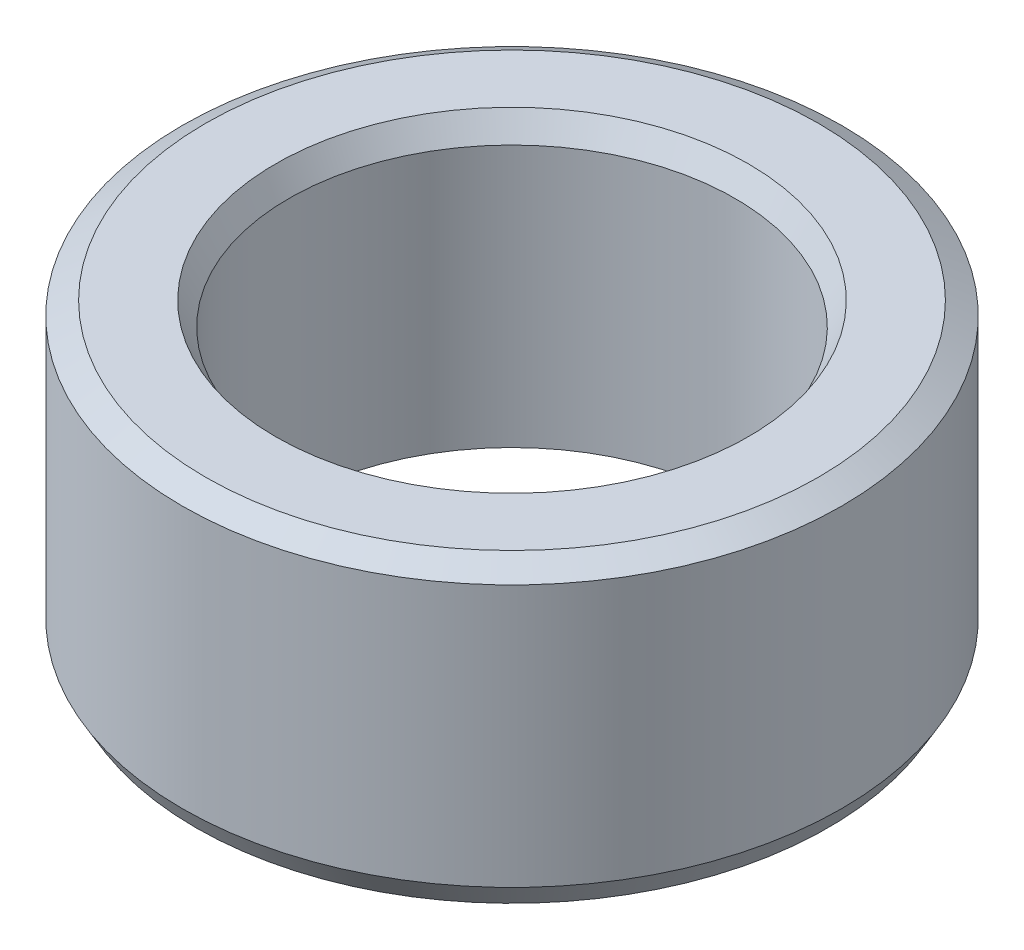
ISO-10303-21;
HEADER;
FILE_DESCRIPTION(('STEP AP214'),'2;1');
FILE_NAME('part.step','',(''),(''),'','','');
FILE_SCHEMA(('AUTOMOTIVE_DESIGN { 1 0 10303 214 1 1 1 1 }'));
ENDSEC;
DATA;
#1=APPLICATION_CONTEXT('core data for automotive mechanical design processes');
#2=APPLICATION_PROTOCOL_DEFINITION('international standard','automotive_design',2000,#1);
#3=PRODUCT_CONTEXT('',#1,'mechanical');
#4=PRODUCT('Part','Part','',(#3));
#5=PRODUCT_RELATED_PRODUCT_CATEGORY('part','',(#4));
#6=PRODUCT_DEFINITION_FORMATION('','',#4);
#7=PRODUCT_DEFINITION_CONTEXT('part definition',#1,'design');
#8=PRODUCT_DEFINITION('design','',#6,#7);
#9=PRODUCT_DEFINITION_SHAPE('','',#8);
#10=(LENGTH_UNIT() NAMED_UNIT(*) SI_UNIT(.MILLI.,.METRE.));
#11=(NAMED_UNIT(*) PLANE_ANGLE_UNIT() SI_UNIT($,.RADIAN.));
#12=(NAMED_UNIT(*) SI_UNIT($,.STERADIAN.) SOLID_ANGLE_UNIT());
#13=UNCERTAINTY_MEASURE_WITH_UNIT(LENGTH_MEASURE(1.E-05),#10,'distance_accuracy_value','');
#14=(GEOMETRIC_REPRESENTATION_CONTEXT(3) GLOBAL_UNCERTAINTY_ASSIGNED_CONTEXT((#13)) GLOBAL_UNIT_ASSIGNED_CONTEXT((#10,
#11,#12)) REPRESENTATION_CONTEXT('',''));
#15=CARTESIAN_POINT('',(0.,0.,0.));
#16=DIRECTION('',(0.,0.,1.));
#17=DIRECTION('',(1.,0.,0.));
#18=AXIS2_PLACEMENT_3D('',#15,#16,#17);
#19=CARTESIAN_POINT('',(0.,36.2287113166267,0.));
#20=DIRECTION('',(0.,-1.,0.));
#21=DIRECTION('',(0.,0.,-1.));
#22=AXIS2_PLACEMENT_3D('',#19,#20,#21);
#23=CYLINDRICAL_SURFACE('',#22,40.);
#24=CARTESIAN_POINT('',(0.,2.81705844941749,0.));
#25=DIRECTION('',(0.,1.,0.));
#26=DIRECTION('',(0.,0.,1.));
#27=AXIS2_PLACEMENT_3D('',#24,#25,#26);
#28=CIRCLE('',#27,40.);
#29=CARTESIAN_POINT('',(0.,2.81705844941749,40.));
#30=VERTEX_POINT('',#29);
#31=EDGE_CURVE('E10',#30,#30,#28,.T.);
#32=ORIENTED_EDGE('',*,*,#31,.T.);
#33=EDGE_LOOP('',(#32));
#34=FACE_BOUND('',#33,.T.);
#35=CARTESIAN_POINT('',(0.,34.6022818625326,0.));
#36=DIRECTION('',(0.,1.,0.));
#37=DIRECTION('',(0.,0.,1.));
#38=AXIS2_PLACEMENT_3D('',#35,#36,#37);
#39=CIRCLE('',#38,40.);
#40=CARTESIAN_POINT('',(0.,34.6022818625326,-40.));
#41=VERTEX_POINT('',#40);
#42=EDGE_CURVE('E50',#41,#41,#39,.F.);
#43=ORIENTED_EDGE('',*,*,#42,.T.);
#44=EDGE_LOOP('',(#43));
#45=FACE_BOUND('',#44,.T.);
#46=ADVANCED_FACE('F39',(#34,#45),#23,.T.);
#47=CARTESIAN_POINT('',(0.,36.2287113166267,0.));
#48=DIRECTION('',(0.,1.,0.));
#49=DIRECTION('',(0.,0.,1.));
#50=AXIS2_PLACEMENT_3D('',#47,#48,#49);
#51=PLANE('',#50);
#52=CARTESIAN_POINT('',(0.,36.2287113166267,0.));
#53=DIRECTION('',(0.,1.,0.));
#54=DIRECTION('',(0.,0.,1.));
#55=AXIS2_PLACEMENT_3D('',#52,#53,#54);
#56=CIRCLE('',#55,28.6802328543854);
#57=CARTESIAN_POINT('',(0.,36.2287113166267,28.6802328543854));
#58=VERTEX_POINT('',#57);
#59=EDGE_CURVE('E58',#58,#58,#56,.F.);
#60=ORIENTED_EDGE('',*,*,#59,.T.);
#61=EDGE_LOOP('',(#60));
#62=FACE_BOUND('',#61,.T.);
#63=CARTESIAN_POINT('',(0.,36.2287113166267,0.));
#64=DIRECTION('',(0.,1.,0.));
#65=DIRECTION('',(0.,0.,1.));
#66=AXIS2_PLACEMENT_3D('',#63,#64,#65);
#67=CIRCLE('',#66,37.1829415505825);
#68=CARTESIAN_POINT('',(0.,36.2287113166267,-37.1829415505826));
#69=VERTEX_POINT('',#68);
#70=EDGE_CURVE('E61',#69,#69,#67,.T.);
#71=ORIENTED_EDGE('',*,*,#70,.T.);
#72=EDGE_LOOP('',(#71));
#73=FACE_BOUND('',#72,.T.);
#74=ADVANCED_FACE('F88',(#62,#73),#51,.T.);
#75=CARTESIAN_POINT('',(0.,0.,0.));
#76=DIRECTION('',(0.,1.,0.));
#77=DIRECTION('',(0.,0.,1.));
#78=AXIS2_PLACEMENT_3D('',#75,#76,#77);
#79=PLANE('',#78);
#80=CARTESIAN_POINT('',(0.,0.,0.));
#81=DIRECTION('',(0.,1.,0.));
#82=DIRECTION('',(0.,0.,1.));
#83=AXIS2_PLACEMENT_3D('',#80,#81,#82);
#84=CIRCLE('',#83,29.8708618497088);
#85=CARTESIAN_POINT('',(0.,0.,29.8708618497088));
#86=VERTEX_POINT('',#85);
#87=EDGE_CURVE('E51',#86,#86,#84,.T.);
#88=ORIENTED_EDGE('',*,*,#87,.T.);
#89=EDGE_LOOP('',(#88));
#90=FACE_BOUND('',#89,.T.);
#91=CARTESIAN_POINT('',(0.,0.,0.));
#92=DIRECTION('',(0.,1.,0.));
#93=DIRECTION('',(0.,0.,1.));
#94=AXIS2_PLACEMENT_3D('',#91,#92,#93);
#95=CIRCLE('',#94,38.3735705459059);
#96=CARTESIAN_POINT('',(0.,0.,38.3735705459059));
#97=VERTEX_POINT('',#96);
#98=EDGE_CURVE('E54',#97,#97,#95,.F.);
#99=ORIENTED_EDGE('',*,*,#98,.T.);
#100=EDGE_LOOP('',(#99));
#101=FACE_BOUND('',#100,.T.);
#102=ADVANCED_FACE('F83',(#90,#101),#79,.F.);
#103=CARTESIAN_POINT('',(0.,36.2287113166267,0.));
#104=DIRECTION('',(0.,-1.,0.));
#105=DIRECTION('',(0.,0.,-1.));
#106=AXIS2_PLACEMENT_3D('',#103,#104,#105);
#107=CYLINDRICAL_SURFACE('',#106,27.0538034002913);
#108=CARTESIAN_POINT('',(0.,33.4116528672092,0.));
#109=DIRECTION('',(0.,1.,0.));
#110=DIRECTION('',(0.,0.,1.));
#111=AXIS2_PLACEMENT_3D('',#108,#109,#110);
#112=CIRCLE('',#111,27.0538034002913);
#113=CARTESIAN_POINT('',(0.,33.4116528672092,27.0538034002913));
#114=VERTEX_POINT('',#113);
#115=EDGE_CURVE('E67',#114,#114,#112,.T.);
#116=ORIENTED_EDGE('',*,*,#115,.T.);
#117=EDGE_LOOP('',(#116));
#118=FACE_BOUND('',#117,.T.);
#119=CARTESIAN_POINT('',(0.,1.6264294540941,0.));
#120=DIRECTION('',(0.,1.,0.));
#121=DIRECTION('',(0.,0.,1.));
#122=AXIS2_PLACEMENT_3D('',#119,#120,#121);
#123=CIRCLE('',#122,27.0538034002913);
#124=CARTESIAN_POINT('',(0.,1.6264294540941,27.0538034002913));
#125=VERTEX_POINT('',#124);
#126=EDGE_CURVE('E69',#125,#125,#123,.F.);
#127=ORIENTED_EDGE('',*,*,#126,.T.);
#128=EDGE_LOOP('',(#127));
#129=FACE_BOUND('',#128,.T.);
#130=ADVANCED_FACE('F71',(#118,#129),#107,.F.);
#131=CARTESIAN_POINT('',(0.,33.4116528672092,0.));
#132=DIRECTION('',(0.,1.,0.));
#133=DIRECTION('',(0.,0.,1.));
#134=AXIS2_PLACEMENT_3D('',#131,#132,#133);
#135=CONICAL_SURFACE('',#134,27.0538034002913,0.523598775598302);
#136=ORIENTED_EDGE('',*,*,#59,.F.);
#137=EDGE_LOOP('',(#136));
#138=FACE_BOUND('',#137,.T.);
#139=ORIENTED_EDGE('',*,*,#115,.F.);
#140=EDGE_LOOP('',(#139));
#141=FACE_BOUND('',#140,.T.);
#142=ADVANCED_FACE('F77',(#138,#141),#135,.F.);
#143=CARTESIAN_POINT('',(0.,0.,0.));
#144=DIRECTION('',(0.,-1.,0.));
#145=DIRECTION('',(0.,0.,-1.));
#146=AXIS2_PLACEMENT_3D('',#143,#144,#145);
#147=CONICAL_SURFACE('',#146,29.8708618497088,1.04719755119659);
#148=ORIENTED_EDGE('',*,*,#126,.F.);
#149=EDGE_LOOP('',(#148));
#150=FACE_BOUND('',#149,.T.);
#151=ORIENTED_EDGE('',*,*,#87,.F.);
#152=EDGE_LOOP('',(#151));
#153=FACE_BOUND('',#152,.T.);
#154=ADVANCED_FACE('F73',(#150,#153),#147,.F.);
#155=CARTESIAN_POINT('',(0.,2.81705844941749,0.));
#156=DIRECTION('',(0.,1.,0.));
#157=DIRECTION('',(0.,0.,1.));
#158=AXIS2_PLACEMENT_3D('',#155,#156,#157);
#159=CONICAL_SURFACE('',#158,40.,0.523598775598302);
#160=ORIENTED_EDGE('',*,*,#98,.F.);
#161=EDGE_LOOP('',(#160));
#162=FACE_BOUND('',#161,.T.);
#163=ORIENTED_EDGE('',*,*,#31,.F.);
#164=EDGE_LOOP('',(#163));
#165=FACE_BOUND('',#164,.T.);
#166=ADVANCED_FACE('F76',(#162,#165),#159,.T.);
#167=CARTESIAN_POINT('',(0.,36.2287113166267,0.));
#168=DIRECTION('',(0.,-1.,0.));
#169=DIRECTION('',(0.,0.,-1.));
#170=AXIS2_PLACEMENT_3D('',#167,#168,#169);
#171=CONICAL_SURFACE('',#170,37.1829415505825,1.04719755119659);
#172=CARTESIAN_POINT('',(0.,34.6022818625326,-40.));
#173=CARTESIAN_POINT('',(0.,34.6192238360127,-39.9706556411519));
#174=CARTESIAN_POINT('',(0.,34.6361658094929,-39.9413112823038));
#175=CARTESIAN_POINT('',(0.,34.6700497564532,-39.8826225646076));
#176=CARTESIAN_POINT('',(0.,34.6869917299333,-39.8532782057595));
#177=CARTESIAN_POINT('',(0.,34.7208756768936,-39.7945894880633));
#178=CARTESIAN_POINT('',(0.,34.7378176503737,-39.7652451292152));
#179=CARTESIAN_POINT('',(0.,34.771701597334,-39.706556411519));
#180=CARTESIAN_POINT('',(0.,34.7886435708142,-39.6772120526709));
#181=CARTESIAN_POINT('',(0.,34.8225275177745,-39.6185233349747));
#182=CARTESIAN_POINT('',(0.,34.8394694912546,-39.5891789761266));
#183=CARTESIAN_POINT('',(0.,34.8733534382149,-39.5304902584304));
#184=CARTESIAN_POINT('',(0.,34.8902954116951,-39.5011458995823));
#185=CARTESIAN_POINT('',(0.,34.9241793586554,-39.4424571818861));
#186=CARTESIAN_POINT('',(0.,34.9411213321355,-39.413112823038));
#187=CARTESIAN_POINT('',(0.,34.9750052790958,-39.3544241053418));
#188=CARTESIAN_POINT('',(0.,34.9919472525759,-39.3250797464937));
#189=CARTESIAN_POINT('',(0.,35.0258311995362,-39.2663910287975));
#190=CARTESIAN_POINT('',(0.,35.0427731730164,-39.2370466699495));
#191=CARTESIAN_POINT('',(0.,35.0766571199767,-39.1783579522533));
#192=CARTESIAN_POINT('',(0.,35.0935990934568,-39.1490135934052));
#193=CARTESIAN_POINT('',(0.,35.1274830404171,-39.090324875709));
#194=CARTESIAN_POINT('',(0.,35.1444250138973,-39.0609805168609));
#195=CARTESIAN_POINT('',(0.,35.1783089608575,-39.0022917991647));
#196=CARTESIAN_POINT('',(0.,35.1952509343377,-38.9729474403166));
#197=CARTESIAN_POINT('',(0.,35.229134881298,-38.9142587226204));
#198=CARTESIAN_POINT('',(0.,35.2460768547781,-38.8849143637723));
#199=CARTESIAN_POINT('',(0.,35.2799608017384,-38.8262256460761));
#200=CARTESIAN_POINT('',(0.,35.2969027752186,-38.796881287228));
#201=CARTESIAN_POINT('',(0.,35.3307867221789,-38.7381925695318));
#202=CARTESIAN_POINT('',(0.,35.347728695659,-38.7088482106837));
#203=CARTESIAN_POINT('',(0.,35.3816126426193,-38.6501594929875));
#204=CARTESIAN_POINT('',(0.,35.3985546160995,-38.6208151341394));
#205=CARTESIAN_POINT('',(0.,35.4324385630598,-38.5621264164432));
#206=CARTESIAN_POINT('',(0.,35.4493805365399,-38.5327820575951));
#207=CARTESIAN_POINT('',(0.,35.4832644835002,-38.4740933398989));
#208=CARTESIAN_POINT('',(0.,35.5002064569804,-38.4447489810508));
#209=CARTESIAN_POINT('',(0.,35.5340904039406,-38.3860602633546));
#210=CARTESIAN_POINT('',(0.,35.5510323774208,-38.3567159045065));
#211=CARTESIAN_POINT('',(0.,35.5849163243811,-38.2980271868103));
#212=CARTESIAN_POINT('',(0.,35.6018582978612,-38.2686828279622));
#213=CARTESIAN_POINT('',(0.,35.6357422448215,-38.209994110266));
#214=CARTESIAN_POINT('',(0.,35.6526842183017,-38.1806497514179));
#215=CARTESIAN_POINT('',(0.,35.686568165262,-38.1219610337217));
#216=CARTESIAN_POINT('',(0.,35.7035101387421,-38.0926166748736));
#217=CARTESIAN_POINT('',(0.,35.7373940857024,-38.0339279571774));
#218=CARTESIAN_POINT('',(0.,35.7543360591825,-38.0045835983293));
#219=CARTESIAN_POINT('',(0.,35.7882200061428,-37.9458948806331));
#220=CARTESIAN_POINT('',(0.,35.805161979623,-37.916550521785));
#221=CARTESIAN_POINT('',(0.,35.8390459265833,-37.8578618040888));
#222=CARTESIAN_POINT('',(0.,35.8559879000634,-37.8285174452407));
#223=CARTESIAN_POINT('',(0.,35.8898718470237,-37.7698287275445));
#224=CARTESIAN_POINT('',(0.,35.9068138205039,-37.7404843686964));
#225=CARTESIAN_POINT('',(0.,35.9406977674642,-37.6817956510002));
#226=CARTESIAN_POINT('',(0.,35.9576397409443,-37.6524512921521));
#227=CARTESIAN_POINT('',(0.,35.9915236879046,-37.5937625744559));
#228=CARTESIAN_POINT('',(0.,36.0084656613847,-37.5644182156078));
#229=CARTESIAN_POINT('',(0.,36.042349608345,-37.5057294979116));
#230=CARTESIAN_POINT('',(0.,36.0592915818252,-37.4763851390635));
#231=CARTESIAN_POINT('',(0.,36.0931755287855,-37.4176964213673));
#232=CARTESIAN_POINT('',(0.,36.1101175022656,-37.3883520625192));
#233=CARTESIAN_POINT('',(0.,36.1440014492259,-37.3296633448231));
#234=CARTESIAN_POINT('',(0.,36.1609434227061,-37.3003189859749));
#235=CARTESIAN_POINT('',(0.,36.1948273696664,-37.2416302682788));
#236=CARTESIAN_POINT('',(0.,36.2117693431465,-37.2122859094307));
#237=CARTESIAN_POINT('',(0.,36.2287113166267,-37.1829415505826));
#238=B_SPLINE_CURVE_WITH_KNOTS('',3,(#172,#173,#174,#175,#176,#177,#178,#179,#180,#181,#182,
#183,#184,#185,#186,#187,#188,#189,#190,#191,#192,#193,#194,#195,#196,#197,#198,#199,#200,#201,
#202,#203,#204,#205,#206,#207,#208,#209,#210,#211,#212,#213,#214,#215,#216,#217,#218,#219,#220,
#221,#222,#223,#224,#225,#226,#227,#228,#229,#230,#231,#232,#233,#234,#235,#236,#237),
.UNSPECIFIED.,.F.,.F.,(4,2,2,2,2,2,2,2,2,2,2,2,2,2,2,2,2,2,2,2,2,2,2,2,2,2,2,2,2,2,2,2,4),(0.,
0.101651840880879,0.203303681761765,0.304955522642641,0.40660736352352,0.508259204404402,
0.609911045285282,0.711562886166164,0.813214727047043,0.914866567927919,1.0165184088088,
1.11817024968968,1.21982209057056,1.32147393145144,1.42312577233232,1.5247776132132,
1.62642945409408,1.72808129497496,1.82973313585584,1.93138497673672,2.0330368176176,
2.13468865849848,2.23634049937936,2.33799234026024,2.43964418114112,2.541296022022,
2.64294786290288,2.74459970378376,2.84625154466464,2.94790338554552,3.0495552264264,
3.15120706730728,3.25285890818816),.UNSPECIFIED.);
#239=EDGE_CURVE('BSEAM45',#41,#69,#238,.T.);
#240=ORIENTED_EDGE('',*,*,#42,.F.);
#241=ORIENTED_EDGE('',*,*,#70,.F.);
#242=ORIENTED_EDGE('',*,*,#239,.T.);
#243=ORIENTED_EDGE('',*,*,#239,.F.);
#244=EDGE_LOOP('',(#240,#242,#241,#243));
#245=FACE_BOUND('',#244,.T.);
#246=ADVANCED_FACE('F45',(#245),#171,.T.);
#247=CLOSED_SHELL('',(#46,#74,#102,#130,#142,#154,#166,#246));
#248=MANIFOLD_SOLID_BREP('B2',#247);
#249=ADVANCED_BREP_SHAPE_REPRESENTATION('',(#18,#248),#14);
#250=SHAPE_DEFINITION_REPRESENTATION(#9,#249);
ENDSEC;
END-ISO-10303-21;
